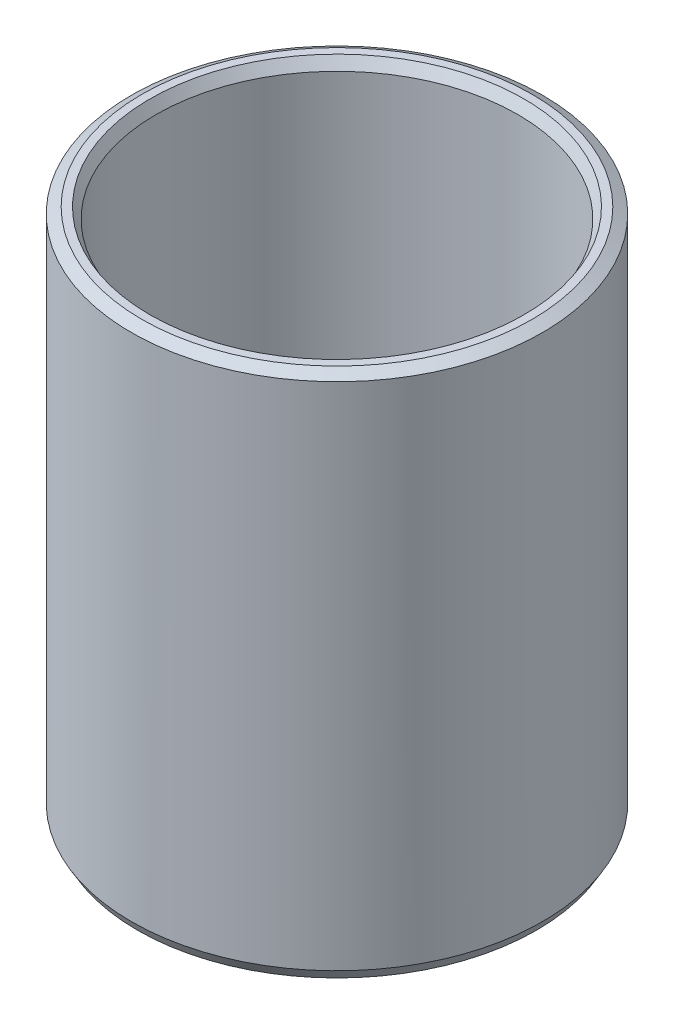
ISO-10303-21;
HEADER;
FILE_DESCRIPTION(('STEP AP214'),'2;1');
FILE_NAME('part.step','',(''),(''),'','','');
FILE_SCHEMA(('AUTOMOTIVE_DESIGN { 1 0 10303 214 1 1 1 1 }'));
ENDSEC;
DATA;
#1=APPLICATION_CONTEXT('core data for automotive mechanical design processes');
#2=APPLICATION_PROTOCOL_DEFINITION('international standard','automotive_design',2000,#1);
#3=PRODUCT_CONTEXT('',#1,'mechanical');
#4=PRODUCT('Part','Part','',(#3));
#5=PRODUCT_RELATED_PRODUCT_CATEGORY('part','',(#4));
#6=PRODUCT_DEFINITION_FORMATION('','',#4);
#7=PRODUCT_DEFINITION_CONTEXT('part definition',#1,'design');
#8=PRODUCT_DEFINITION('design','',#6,#7);
#9=PRODUCT_DEFINITION_SHAPE('','',#8);
#10=(LENGTH_UNIT() NAMED_UNIT(*) SI_UNIT(.MILLI.,.METRE.));
#11=(NAMED_UNIT(*) PLANE_ANGLE_UNIT() SI_UNIT($,.RADIAN.));
#12=(NAMED_UNIT(*) SI_UNIT($,.STERADIAN.) SOLID_ANGLE_UNIT());
#13=UNCERTAINTY_MEASURE_WITH_UNIT(LENGTH_MEASURE(1.E-05),#10,'distance_accuracy_value','');
#14=(GEOMETRIC_REPRESENTATION_CONTEXT(3) GLOBAL_UNCERTAINTY_ASSIGNED_CONTEXT((#13)) GLOBAL_UNIT_ASSIGNED_CONTEXT((#10,
#11,#12)) REPRESENTATION_CONTEXT('',''));
#15=CARTESIAN_POINT('',(0.,0.,0.));
#16=DIRECTION('',(0.,0.,1.));
#17=DIRECTION('',(1.,0.,0.));
#18=AXIS2_PLACEMENT_3D('',#15,#16,#17);
#19=CARTESIAN_POINT('',(0.,108.890767870196,0.));
#20=DIRECTION('',(0.,-1.,0.));
#21=DIRECTION('',(0.,0.,-1.));
#22=AXIS2_PLACEMENT_3D('',#19,#20,#21);
#23=CYLINDRICAL_SURFACE('',#22,42.5);
#24=CARTESIAN_POINT('',(0.,2.17954427908287,0.));
#25=DIRECTION('',(0.,1.,0.));
#26=DIRECTION('',(0.,0.,1.));
#27=AXIS2_PLACEMENT_3D('',#24,#25,#26);
#28=CIRCLE('',#27,42.5);
#29=CARTESIAN_POINT('',(0.,2.17954427908287,-42.5));
#30=VERTEX_POINT('',#29);
#31=EDGE_CURVE('E10',#30,#30,#28,.T.);
#32=CARTESIAN_POINT('',(0.,107.632407393957,0.));
#33=DIRECTION('',(0.,1.,0.));
#34=DIRECTION('',(0.,0.,1.));
#35=AXIS2_PLACEMENT_3D('',#32,#33,#34);
#36=CIRCLE('',#35,42.5);
#37=CARTESIAN_POINT('',(0.,107.632407393957,-42.5));
#38=VERTEX_POINT('',#37);
#39=EDGE_CURVE('E50',#38,#38,#36,.F.);
#40=CARTESIAN_POINT('',(0.,2.17954427908287,-42.5));
#41=CARTESIAN_POINT('',(0.,3.27801160319614,-42.5));
#42=CARTESIAN_POINT('',(0.,4.37647892730941,-42.5));
#43=CARTESIAN_POINT('',(0.,6.57341357553595,-42.5));
#44=CARTESIAN_POINT('',(0.,7.67188089964922,-42.5));
#45=CARTESIAN_POINT('',(0.,9.86881554787576,-42.5));
#46=CARTESIAN_POINT('',(0.,10.967282871989,-42.5));
#47=CARTESIAN_POINT('',(0.,13.1642175202156,-42.5));
#48=CARTESIAN_POINT('',(0.,14.2626848443288,-42.5));
#49=CARTESIAN_POINT('',(0.,16.4596194925554,-42.5));
#50=CARTESIAN_POINT('',(0.,17.5580868166686,-42.5));
#51=CARTESIAN_POINT('',(0.,19.7550214648952,-42.5));
#52=CARTESIAN_POINT('',(0.,20.8534887890085,-42.5));
#53=CARTESIAN_POINT('',(0.,23.050423437235,-42.5));
#54=CARTESIAN_POINT('',(0.,24.1488907613483,-42.5));
#55=CARTESIAN_POINT('',(0.,26.3458254095748,-42.5));
#56=CARTESIAN_POINT('',(0.,27.4442927336881,-42.5));
#57=CARTESIAN_POINT('',(0.,29.6412273819146,-42.5));
#58=CARTESIAN_POINT('',(0.,30.7396947060279,-42.5));
#59=CARTESIAN_POINT('',(0.,32.9366293542544,-42.5));
#60=CARTESIAN_POINT('',(0.,34.0350966783677,-42.5));
#61=CARTESIAN_POINT('',(0.,36.2320313265942,-42.5));
#62=CARTESIAN_POINT('',(0.,37.3304986507075,-42.5));
#63=CARTESIAN_POINT('',(0.,39.5274332989341,-42.5));
#64=CARTESIAN_POINT('',(0.,40.6259006230473,-42.5));
#65=CARTESIAN_POINT('',(0.,42.8228352712739,-42.5));
#66=CARTESIAN_POINT('',(0.,43.9213025953871,-42.5));
#67=CARTESIAN_POINT('',(0.,46.1182372436137,-42.5));
#68=CARTESIAN_POINT('',(0.,47.2167045677269,-42.5));
#69=CARTESIAN_POINT('',(0.,49.4136392159535,-42.5));
#70=CARTESIAN_POINT('',(0.,50.5121065400667,-42.5));
#71=CARTESIAN_POINT('',(0.,52.7090411882933,-42.5));
#72=CARTESIAN_POINT('',(0.,53.8075085124066,-42.5));
#73=CARTESIAN_POINT('',(0.,56.0044431606331,-42.5));
#74=CARTESIAN_POINT('',(0.,57.1029104847464,-42.5));
#75=CARTESIAN_POINT('',(0.,59.2998451329729,-42.5));
#76=CARTESIAN_POINT('',(0.,60.3983124570862,-42.5));
#77=CARTESIAN_POINT('',(0.,62.5952471053127,-42.5));
#78=CARTESIAN_POINT('',(0.,63.693714429426,-42.5));
#79=CARTESIAN_POINT('',(0.,65.8906490776525,-42.5));
#80=CARTESIAN_POINT('',(0.,66.9891164017658,-42.5));
#81=CARTESIAN_POINT('',(0.,69.1860510499923,-42.5));
#82=CARTESIAN_POINT('',(0.,70.2845183741056,-42.5));
#83=CARTESIAN_POINT('',(0.,72.4814530223321,-42.5));
#84=CARTESIAN_POINT('',(0.,73.5799203464454,-42.5));
#85=CARTESIAN_POINT('',(0.,75.776854994672,-42.5));
#86=CARTESIAN_POINT('',(0.,76.8753223187852,-42.5));
#87=CARTESIAN_POINT('',(0.,79.0722569670118,-42.5));
#88=CARTESIAN_POINT('',(0.,80.170724291125,-42.5));
#89=CARTESIAN_POINT('',(0.,82.3676589393516,-42.5));
#90=CARTESIAN_POINT('',(0.,83.4661262634648,-42.5));
#91=CARTESIAN_POINT('',(0.,85.6630609116914,-42.5));
#92=CARTESIAN_POINT('',(0.,86.7615282358047,-42.5));
#93=CARTESIAN_POINT('',(0.,88.9584628840312,-42.5));
#94=CARTESIAN_POINT('',(0.,90.0569302081445,-42.5));
#95=CARTESIAN_POINT('',(0.,92.253864856371,-42.5));
#96=CARTESIAN_POINT('',(0.,93.3523321804843,-42.5));
#97=CARTESIAN_POINT('',(0.,95.5492668287108,-42.5));
#98=CARTESIAN_POINT('',(0.,96.6477341528241,-42.5));
#99=CARTESIAN_POINT('',(0.,98.8446688010506,-42.5));
#100=CARTESIAN_POINT('',(0.,99.9431361251639,-42.5));
#101=CARTESIAN_POINT('',(0.,102.14007077339,-42.5));
#102=CARTESIAN_POINT('',(0.,103.238538097504,-42.5));
#103=CARTESIAN_POINT('',(0.,105.43547274573,-42.5));
#104=CARTESIAN_POINT('',(0.,106.533940069844,-42.5));
#105=CARTESIAN_POINT('',(0.,107.632407393957,-42.5));
#106=B_SPLINE_CURVE_WITH_KNOTS('',3,(#40,#41,#42,#43,#44,#45,#46,#47,#48,#49,#50,#51,#52,#53,
#54,#55,#56,#57,#58,#59,#60,#61,#62,#63,#64,#65,#66,#67,#68,#69,#70,#71,#72,#73,#74,#75,#76,#77,
#78,#79,#80,#81,#82,#83,#84,#85,#86,#87,#88,#89,#90,#91,#92,#93,#94,#95,#96,#97,#98,#99,#100,
#101,#102,#103,#104,#105),.UNSPECIFIED.,.F.,.F.,(4,2,2,2,2,2,2,2,2,2,2,2,2,2,2,2,2,2,2,2,2,2,2,
2,2,2,2,2,2,2,2,2,4),(0.,3.29540197233981,6.59080394467962,9.88620591701943,13.1816078893592,
16.477009861699,19.7724118340389,23.0678138063787,26.3632157787185,29.6586177510583,
32.9540197233981,36.2494216957379,39.5448236680777,42.8402256404175,46.1356276127573,
49.4310295850971,52.726431557437,56.0218335297768,59.3172355021166,62.6126374744564,
65.9080394467962,69.203441419136,72.4988433914758,75.7942453638156,79.0896473361554,
82.3850493084952,85.6804512808351,88.9758532531749,92.2712552255147,95.5666571978545,
98.8620591701943,102.157461142534,105.452863114874),.UNSPECIFIED.);
#107=EDGE_CURVE('BSEAM39',#30,#38,#106,.T.);
#108=ORIENTED_EDGE('',*,*,#31,.T.);
#109=ORIENTED_EDGE('',*,*,#39,.T.);
#110=ORIENTED_EDGE('',*,*,#107,.T.);
#111=ORIENTED_EDGE('',*,*,#107,.F.);
#112=EDGE_LOOP('',(#108,#110,#109,#111));
#113=FACE_BOUND('',#112,.T.);
#114=ADVANCED_FACE('F39',(#113),#23,.T.);
#115=CARTESIAN_POINT('',(0.,108.890767870196,0.));
#116=DIRECTION('',(0.,1.,0.));
#117=DIRECTION('',(0.,0.,1.));
#118=AXIS2_PLACEMENT_3D('',#115,#116,#117);
#119=PLANE('',#118);
#120=CARTESIAN_POINT('',(0.,108.890767870196,0.));
#121=DIRECTION('',(0.,1.,0.));
#122=DIRECTION('',(0.,0.,1.));
#123=AXIS2_PLACEMENT_3D('',#120,#121,#122);
#124=CIRCLE('',#123,38.6635582372458);
#125=CARTESIAN_POINT('',(0.,108.890767870196,38.6635582372458));
#126=VERTEX_POINT('',#125);
#127=EDGE_CURVE('E58',#126,#126,#124,.F.);
#128=ORIENTED_EDGE('',*,*,#127,.T.);
#129=EDGE_LOOP('',(#128));
#130=FACE_BOUND('',#129,.T.);
#131=CARTESIAN_POINT('',(0.,108.890767870196,0.));
#132=DIRECTION('',(0.,1.,0.));
#133=DIRECTION('',(0.,0.,1.));
#134=AXIS2_PLACEMENT_3D('',#131,#132,#133);
#135=CIRCLE('',#134,40.3204557209174);
#136=CARTESIAN_POINT('',(0.,108.890767870196,40.3204557209174));
#137=VERTEX_POINT('',#136);
#138=EDGE_CURVE('E61',#137,#137,#135,.T.);
#139=ORIENTED_EDGE('',*,*,#138,.T.);
#140=EDGE_LOOP('',(#139));
#141=FACE_BOUND('',#140,.T.);
#142=ADVANCED_FACE('F88',(#130,#141),#119,.T.);
#143=CARTESIAN_POINT('',(0.,0.,0.));
#144=DIRECTION('',(0.,1.,0.));
#145=DIRECTION('',(0.,0.,1.));
#146=AXIS2_PLACEMENT_3D('',#143,#144,#145);
#147=PLANE('',#146);
#148=CARTESIAN_POINT('',(0.,0.,0.));
#149=DIRECTION('',(0.,1.,0.));
#150=DIRECTION('',(0.,0.,1.));
#151=AXIS2_PLACEMENT_3D('',#148,#149,#150);
#152=CIRCLE('',#151,39.5847420400892);
#153=CARTESIAN_POINT('',(0.,0.,39.5847420400892));
#154=VERTEX_POINT('',#153);
#155=EDGE_CURVE('E51',#154,#154,#152,.T.);
#156=ORIENTED_EDGE('',*,*,#155,.T.);
#157=EDGE_LOOP('',(#156));
#158=FACE_BOUND('',#157,.T.);
#159=CARTESIAN_POINT('',(0.,0.,0.));
#160=DIRECTION('',(0.,1.,0.));
#161=DIRECTION('',(0.,0.,1.));
#162=AXIS2_PLACEMENT_3D('',#159,#160,#161);
#163=CIRCLE('',#162,41.2416395237608);
#164=CARTESIAN_POINT('',(0.,0.,41.2416395237608));
#165=VERTEX_POINT('',#164);
#166=EDGE_CURVE('E54',#165,#165,#163,.F.);
#167=ORIENTED_EDGE('',*,*,#166,.T.);
#168=EDGE_LOOP('',(#167));
#169=FACE_BOUND('',#168,.T.);
#170=ADVANCED_FACE('F83',(#158,#169),#147,.F.);
#171=CARTESIAN_POINT('',(0.,108.890767870196,0.));
#172=DIRECTION('',(0.,-1.,0.));
#173=DIRECTION('',(0.,0.,-1.));
#174=AXIS2_PLACEMENT_3D('',#171,#172,#173);
#175=CYLINDRICAL_SURFACE('',#174,37.4051977610066);
#176=CARTESIAN_POINT('',(0.,106.711223591113,0.));
#177=DIRECTION('',(0.,1.,0.));
#178=DIRECTION('',(0.,0.,1.));
#179=AXIS2_PLACEMENT_3D('',#176,#177,#178);
#180=CIRCLE('',#179,37.4051977610066);
#181=CARTESIAN_POINT('',(0.,106.711223591113,-37.4051977610066));
#182=VERTEX_POINT('',#181);
#183=EDGE_CURVE('E67',#182,#182,#180,.T.);
#184=CARTESIAN_POINT('',(0.,1.2583604762391,0.));
#185=DIRECTION('',(0.,1.,0.));
#186=DIRECTION('',(0.,0.,1.));
#187=AXIS2_PLACEMENT_3D('',#184,#185,#186);
#188=CIRCLE('',#187,37.4051977610066);
#189=CARTESIAN_POINT('',(0.,1.25836047623909,-37.4051977610066));
#190=VERTEX_POINT('',#189);
#191=EDGE_CURVE('E69',#190,#190,#188,.F.);
#192=CARTESIAN_POINT('',(0.,106.711223591113,-37.4051977610066));
#193=CARTESIAN_POINT('',(0.,105.612756267,-37.4051977610066));
#194=CARTESIAN_POINT('',(0.,104.514288942886,-37.4051977610066));
#195=CARTESIAN_POINT('',(0.,102.31735429466,-37.4051977610066));
#196=CARTESIAN_POINT('',(0.,101.218886970547,-37.4051977610066));
#197=CARTESIAN_POINT('',(0.,99.0219523223201,-37.4051977610066));
#198=CARTESIAN_POINT('',(0.,97.9234849982068,-37.4051977610066));
#199=CARTESIAN_POINT('',(0.,95.7265503499803,-37.4051977610066));
#200=CARTESIAN_POINT('',(0.,94.628083025867,-37.4051977610066));
#201=CARTESIAN_POINT('',(0.,92.4311483776405,-37.4051977610066));
#202=CARTESIAN_POINT('',(0.,91.3326810535272,-37.4051977610066));
#203=CARTESIAN_POINT('',(0.,89.1357464053006,-37.4051977610066));
#204=CARTESIAN_POINT('',(0.,88.0372790811874,-37.4051977610066));
#205=CARTESIAN_POINT('',(0.,85.8403444329608,-37.4051977610066));
#206=CARTESIAN_POINT('',(0.,84.7418771088476,-37.4051977610066));
#207=CARTESIAN_POINT('',(0.,82.544942460621,-37.4051977610066));
#208=CARTESIAN_POINT('',(0.,81.4464751365078,-37.4051977610066));
#209=CARTESIAN_POINT('',(0.,79.2495404882812,-37.4051977610066));
#210=CARTESIAN_POINT('',(0.,78.151073164168,-37.4051977610066));
#211=CARTESIAN_POINT('',(0.,75.9541385159414,-37.4051977610066));
#212=CARTESIAN_POINT('',(0.,74.8556711918281,-37.4051977610066));
#213=CARTESIAN_POINT('',(0.,72.6587365436016,-37.4051977610066));
#214=CARTESIAN_POINT('',(0.,71.5602692194883,-37.4051977610066));
#215=CARTESIAN_POINT('',(0.,69.3633345712618,-37.4051977610066));
#216=CARTESIAN_POINT('',(0.,68.2648672471485,-37.4051977610066));
#217=CARTESIAN_POINT('',(0.,66.067932598922,-37.4051977610066));
#218=CARTESIAN_POINT('',(0.,64.9694652748087,-37.4051977610066));
#219=CARTESIAN_POINT('',(0.,62.7725306265822,-37.4051977610066));
#220=CARTESIAN_POINT('',(0.,61.6740633024689,-37.4051977610066));
#221=CARTESIAN_POINT('',(0.,59.4771286542424,-37.4051977610066));
#222=CARTESIAN_POINT('',(0.,58.3786613301291,-37.4051977610066));
#223=CARTESIAN_POINT('',(0.,56.1817266819026,-37.4051977610066));
#224=CARTESIAN_POINT('',(0.,55.0832593577893,-37.4051977610066));
#225=CARTESIAN_POINT('',(0.,52.8863247095628,-37.4051977610066));
#226=CARTESIAN_POINT('',(0.,51.7878573854495,-37.4051977610066));
#227=CARTESIAN_POINT('',(0.,49.5909227372229,-37.4051977610066));
#228=CARTESIAN_POINT('',(0.,48.4924554131097,-37.4051977610066));
#229=CARTESIAN_POINT('',(0.,46.2955207648831,-37.4051977610066));
#230=CARTESIAN_POINT('',(0.,45.1970534407699,-37.4051977610066));
#231=CARTESIAN_POINT('',(0.,43.0001187925433,-37.4051977610066));
#232=CARTESIAN_POINT('',(0.,41.9016514684301,-37.4051977610066));
#233=CARTESIAN_POINT('',(0.,39.7047168202035,-37.4051977610066));
#234=CARTESIAN_POINT('',(0.,38.6062494960902,-37.4051977610066));
#235=CARTESIAN_POINT('',(0.,36.4093148478637,-37.4051977610066));
#236=CARTESIAN_POINT('',(0.,35.3108475237504,-37.4051977610066));
#237=CARTESIAN_POINT('',(0.,33.1139128755239,-37.4051977610066));
#238=CARTESIAN_POINT('',(0.,32.0154455514106,-37.4051977610066));
#239=CARTESIAN_POINT('',(0.,29.8185109031841,-37.4051977610066));
#240=CARTESIAN_POINT('',(0.,28.7200435790708,-37.4051977610066));
#241=CARTESIAN_POINT('',(0.,26.5231089308443,-37.4051977610066));
#242=CARTESIAN_POINT('',(0.,25.424641606731,-37.4051977610066));
#243=CARTESIAN_POINT('',(0.,23.2277069585045,-37.4051977610066));
#244=CARTESIAN_POINT('',(0.,22.1292396343912,-37.4051977610066));
#245=CARTESIAN_POINT('',(0.,19.9323049861647,-37.4051977610066));
#246=CARTESIAN_POINT('',(0.,18.8338376620514,-37.4051977610066));
#247=CARTESIAN_POINT('',(0.,16.6369030138249,-37.4051977610066));
#248=CARTESIAN_POINT('',(0.,15.5384356897116,-37.4051977610066));
#249=CARTESIAN_POINT('',(0.,13.3415010414851,-37.4051977610066));
#250=CARTESIAN_POINT('',(0.,12.2430337173718,-37.4051977610066));
#251=CARTESIAN_POINT('',(0.,10.0460990691452,-37.4051977610066));
#252=CARTESIAN_POINT('',(0.,8.94763174503198,-37.4051977610066));
#253=CARTESIAN_POINT('',(0.,6.75069709680544,-37.4051977610066));
#254=CARTESIAN_POINT('',(0.,5.65222977269217,-37.4051977610066));
#255=CARTESIAN_POINT('',(0.,3.45529512446563,-37.4051977610066));
#256=CARTESIAN_POINT('',(0.,2.35682780035236,-37.4051977610066));
#257=CARTESIAN_POINT('',(0.,1.25836047623909,-37.4051977610066));
#258=B_SPLINE_CURVE_WITH_KNOTS('',3,(#192,#193,#194,#195,#196,#197,#198,#199,#200,#201,#202,
#203,#204,#205,#206,#207,#208,#209,#210,#211,#212,#213,#214,#215,#216,#217,#218,#219,#220,#221,
#222,#223,#224,#225,#226,#227,#228,#229,#230,#231,#232,#233,#234,#235,#236,#237,#238,#239,#240,
#241,#242,#243,#244,#245,#246,#247,#248,#249,#250,#251,#252,#253,#254,#255,#256,#257),
.UNSPECIFIED.,.F.,.F.,(4,2,2,2,2,2,2,2,2,2,2,2,2,2,2,2,2,2,2,2,2,2,2,2,2,2,2,2,2,2,2,2,4),(0.,
3.2954019723398,6.5908039446796,9.88620591701941,13.1816078893592,16.477009861699,
19.7724118340388,23.0678138063787,26.3632157787185,29.6586177510583,32.9540197233981,
36.2494216957379,39.5448236680777,42.8402256404175,46.1356276127573,49.4310295850971,
52.7264315574369,56.0218335297767,59.3172355021165,62.6126374744563,65.9080394467962,
69.203441419136,72.4988433914758,75.7942453638156,79.0896473361554,82.3850493084952,
85.680451280835,88.9758532531748,92.2712552255146,95.5666571978544,98.8620591701942,
102.157461142534,105.452863114874),.UNSPECIFIED.);
#259=EDGE_CURVE('BSEAM71',#182,#190,#258,.T.);
#260=ORIENTED_EDGE('',*,*,#183,.T.);
#261=ORIENTED_EDGE('',*,*,#191,.T.);
#262=ORIENTED_EDGE('',*,*,#259,.T.);
#263=ORIENTED_EDGE('',*,*,#259,.F.);
#264=EDGE_LOOP('',(#260,#262,#261,#263));
#265=FACE_BOUND('',#264,.T.);
#266=ADVANCED_FACE('F71',(#265),#175,.F.);
#267=CARTESIAN_POINT('',(0.,106.711223591113,0.));
#268=DIRECTION('',(0.,1.,0.));
#269=DIRECTION('',(0.,0.,1.));
#270=AXIS2_PLACEMENT_3D('',#267,#268,#269);
#271=CONICAL_SURFACE('',#270,37.4051977610066,0.523598775598299);
#272=ORIENTED_EDGE('',*,*,#127,.F.);
#273=EDGE_LOOP('',(#272));
#274=FACE_BOUND('',#273,.T.);
#275=ORIENTED_EDGE('',*,*,#183,.F.);
#276=EDGE_LOOP('',(#275));
#277=FACE_BOUND('',#276,.T.);
#278=ADVANCED_FACE('F77',(#274,#277),#271,.F.);
#279=CARTESIAN_POINT('',(0.,0.,0.));
#280=DIRECTION('',(0.,-1.,0.));
#281=DIRECTION('',(0.,0.,-1.));
#282=AXIS2_PLACEMENT_3D('',#279,#280,#281);
#283=CONICAL_SURFACE('',#282,39.5847420400892,1.0471975511966);
#284=ORIENTED_EDGE('',*,*,#191,.F.);
#285=EDGE_LOOP('',(#284));
#286=FACE_BOUND('',#285,.T.);
#287=ORIENTED_EDGE('',*,*,#155,.F.);
#288=EDGE_LOOP('',(#287));
#289=FACE_BOUND('',#288,.T.);
#290=ADVANCED_FACE('F73',(#286,#289),#283,.F.);
#291=CARTESIAN_POINT('',(0.,2.17954427908287,0.));
#292=DIRECTION('',(0.,1.,0.));
#293=DIRECTION('',(0.,0.,1.));
#294=AXIS2_PLACEMENT_3D('',#291,#292,#293);
#295=CONICAL_SURFACE('',#294,42.5,0.523598775598307);
#296=ORIENTED_EDGE('',*,*,#166,.F.);
#297=EDGE_LOOP('',(#296));
#298=FACE_BOUND('',#297,.T.);
#299=ORIENTED_EDGE('',*,*,#31,.F.);
#300=EDGE_LOOP('',(#299));
#301=FACE_BOUND('',#300,.T.);
#302=ADVANCED_FACE('F76',(#298,#301),#295,.T.);
#303=CARTESIAN_POINT('',(0.,108.890767870196,0.));
#304=DIRECTION('',(0.,-1.,0.));
#305=DIRECTION('',(0.,0.,-1.));
#306=AXIS2_PLACEMENT_3D('',#303,#304,#305);
#307=CONICAL_SURFACE('',#306,40.3204557209174,1.0471975511966);
#308=ORIENTED_EDGE('',*,*,#39,.F.);
#309=EDGE_LOOP('',(#308));
#310=FACE_BOUND('',#309,.T.);
#311=ORIENTED_EDGE('',*,*,#138,.F.);
#312=EDGE_LOOP('',(#311));
#313=FACE_BOUND('',#312,.T.);
#314=ADVANCED_FACE('F45',(#310,#313),#307,.T.);
#315=CLOSED_SHELL('',(#114,#142,#170,#266,#278,#290,#302,#314));
#316=MANIFOLD_SOLID_BREP('B2',#315);
#317=ADVANCED_BREP_SHAPE_REPRESENTATION('',(#18,#316),#14);
#318=SHAPE_DEFINITION_REPRESENTATION(#9,#317);
ENDSEC;
END-ISO-10303-21;
